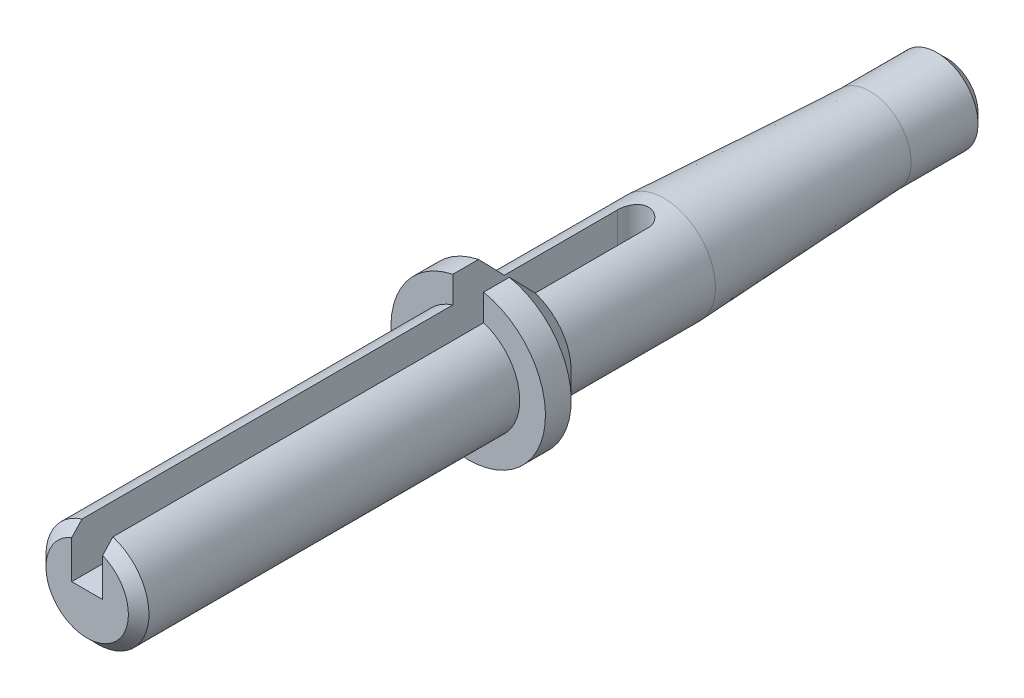
ISO-10303-21;
HEADER;
FILE_DESCRIPTION(('STEP AP214'),'2;1');
FILE_NAME('part.step','',(''),(''),'','','');
FILE_SCHEMA(('AUTOMOTIVE_DESIGN { 1 0 10303 214 1 1 1 1 }'));
ENDSEC;
DATA;
#1=APPLICATION_CONTEXT('core data for automotive mechanical design processes');
#2=APPLICATION_PROTOCOL_DEFINITION('international standard','automotive_design',2000,#1);
#3=PRODUCT_CONTEXT('',#1,'mechanical');
#4=PRODUCT('Part','Part','',(#3));
#5=PRODUCT_RELATED_PRODUCT_CATEGORY('part','',(#4));
#6=PRODUCT_DEFINITION_FORMATION('','',#4);
#7=PRODUCT_DEFINITION_CONTEXT('part definition',#1,'design');
#8=PRODUCT_DEFINITION('design','',#6,#7);
#9=PRODUCT_DEFINITION_SHAPE('','',#8);
#10=(LENGTH_UNIT() NAMED_UNIT(*) SI_UNIT(.MILLI.,.METRE.));
#11=(NAMED_UNIT(*) PLANE_ANGLE_UNIT() SI_UNIT($,.RADIAN.));
#12=(NAMED_UNIT(*) SI_UNIT($,.STERADIAN.) SOLID_ANGLE_UNIT());
#13=UNCERTAINTY_MEASURE_WITH_UNIT(LENGTH_MEASURE(1.E-05),#10,'distance_accuracy_value','');
#14=(GEOMETRIC_REPRESENTATION_CONTEXT(3) GLOBAL_UNCERTAINTY_ASSIGNED_CONTEXT((#13)) GLOBAL_UNIT_ASSIGNED_CONTEXT((#10,
#11,#12)) REPRESENTATION_CONTEXT('',''));
#15=CARTESIAN_POINT('',(0.,0.,0.));
#16=DIRECTION('',(0.,0.,1.));
#17=DIRECTION('',(1.,0.,0.));
#18=AXIS2_PLACEMENT_3D('',#15,#16,#17);
#19=CARTESIAN_POINT('',(0.,0.,16.5));
#20=DIRECTION('',(0.,0.,-1.));
#21=DIRECTION('',(-1.,0.,0.));
#22=AXIS2_PLACEMENT_3D('',#19,#20,#21);
#23=CYLINDRICAL_SURFACE('',#22,5.);
#24=CARTESIAN_POINT('',(0.,0.,0.));
#25=DIRECTION('',(0.,0.,-1.));
#26=DIRECTION('',(-1.,0.,0.));
#27=AXIS2_PLACEMENT_3D('',#24,#25,#26);
#28=CIRCLE('',#27,5.);
#29=CARTESIAN_POINT('',(-5.,0.,0.));
#30=VERTEX_POINT('',#29);
#31=EDGE_CURVE('E260',#30,#30,#28,.T.);
#32=ORIENTED_EDGE('',*,*,#31,.F.);
#33=EDGE_LOOP('',(#32));
#34=FACE_BOUND('',#33,.T.);
#35=DIRECTION('',(0.,0.,-1.));
#36=VECTOR('',#35,1.);
#37=CARTESIAN_POINT('',(-1.49999999999999,4.76969600708473,16.5));
#38=LINE('',#37,#36);
#39=CARTESIAN_POINT('',(-1.49999999999999,4.76969600708473,3.));
#40=VERTEX_POINT('',#39);
#41=CARTESIAN_POINT('',(-1.49999999999999,4.76969600708473,14.));
#42=VERTEX_POINT('',#41);
#43=EDGE_CURVE('E68',#40,#42,#38,.F.);
#44=ORIENTED_EDGE('',*,*,#43,.F.);
#45=CARTESIAN_POINT('',(1.49999999999999,4.76969600708473,3.));
#46=CARTESIAN_POINT('',(1.5000008535707,4.76969249084934,2.95882060709199));
#47=CARTESIAN_POINT('',(1.49830317083427,4.77022997000129,2.91766195687388));
#48=CARTESIAN_POINT('',(1.49153785660316,4.77235095109999,2.83565883790444));
#49=CARTESIAN_POINT('',(1.4864709827584,4.77393421787376,2.79481430060511));
#50=CARTESIAN_POINT('',(1.4663020368931,4.78018490618873,2.67340945904534));
#51=CARTESIAN_POINT('',(1.44623120413662,4.78635370384275,2.59369360958363));
#52=CARTESIAN_POINT('',(1.39353102315626,4.80195952113208,2.43896442161414));
#53=CARTESIAN_POINT('',(1.36090607068203,4.81139539670393,2.36394944780192));
#54=CARTESIAN_POINT('',(1.28407841117655,4.83246571212052,2.2204033184024));
#55=CARTESIAN_POINT('',(1.23987031651226,4.84410117434933,2.15187520027157));
#56=CARTESIAN_POINT('',(1.13964850658325,4.86866835244721,2.02113394400295));
#57=CARTESIAN_POINT('',(1.08333433465208,4.88162755412974,1.9591563396566));
#58=CARTESIAN_POINT('',(0.96113891987335,4.90714811559049,1.84536441610004));
#59=CARTESIAN_POINT('',(0.895256063916344,4.91970940785249,1.79355181399695));
#60=CARTESIAN_POINT('',(0.754109921315427,4.94333239727705,1.70053622968151));
#61=CARTESIAN_POINT('',(0.678680819336256,4.95435770971354,1.65957481970205));
#62=CARTESIAN_POINT('',(0.521621185505772,4.97334469846208,1.59101158838185));
#63=CARTESIAN_POINT('',(0.439992259012926,4.98130716463903,1.56340632220573));
#64=CARTESIAN_POINT('',(0.275324697874878,4.99307639935002,1.52312020089796));
#65=CARTESIAN_POINT('',(0.192393125294253,4.99699549276993,1.51003514203026));
#66=CARTESIAN_POINT('',(0.0254235719980819,5.00063202022426,1.49788265863674));
#67=CARTESIAN_POINT('',(-0.0586141962423622,5.00035024971471,1.49881258029984));
#68=CARTESIAN_POINT('',(-0.222571599946016,4.99569602566267,1.514392908759));
#69=CARTESIAN_POINT('',(-0.30253714546464,4.99145415509187,1.52860534497872));
#70=CARTESIAN_POINT('',(-0.458890052102024,4.9795151369998,1.56963163523811));
#71=CARTESIAN_POINT('',(-0.535277225531996,4.97181780846028,1.59644614945594));
#72=CARTESIAN_POINT('',(-0.683347815892214,4.95365214926145,1.66221222164644));
#73=CARTESIAN_POINT('',(-0.75496600604414,4.94315255692525,1.70130164435695));
#74=CARTESIAN_POINT('',(-0.890765529574417,4.92049624651755,1.79039859004832));
#75=CARTESIAN_POINT('',(-0.954945191614591,4.90833915735884,1.84040855947884));
#76=CARTESIAN_POINT('',(-1.07665450541274,4.88311673571409,1.95219198808352));
#77=CARTESIAN_POINT('',(-1.13383351478033,4.87003445449554,2.01434386376075));
#78=CARTESIAN_POINT('',(-1.23706769492487,4.84484215114658,2.14749742342792));
#79=CARTESIAN_POINT('',(-1.28311962013077,4.83273241337566,2.21850168036553));
#80=CARTESIAN_POINT('',(-1.36316407240863,4.81077228795653,2.36828092844929));
#81=CARTESIAN_POINT('',(-1.39703006341134,4.80094596245948,2.44712717959341));
#82=CARTESIAN_POINT('',(-1.45085886004698,4.78495663653201,2.60972450398174));
#83=CARTESIAN_POINT('',(-1.47084293218035,4.77878803475875,2.69346786071438));
#84=CARTESIAN_POINT('',(-1.48901203590079,4.77314032325006,2.81499488907019));
#85=CARTESIAN_POINT('',(-1.49313202989008,4.77185156275267,2.85189073417961));
#86=CARTESIAN_POINT('',(-1.49862355614853,4.77012928611782,2.92585147909953));
#87=CARTESIAN_POINT('',(-1.49999912968268,4.76969451246644,2.96291604966386));
#88=CARTESIAN_POINT('',(-1.49999999999999,4.76969600708473,3.));
#89=B_SPLINE_CURVE_WITH_KNOTS('',3,(#45,#46,#47,#48,#49,#50,#51,#52,#53,#54,#55,#56,#57,#58,#59,
#60,#61,#62,#63,#64,#65,#66,#67,#68,#69,#70,#71,#72,#73,#74,#75,#76,#77,#78,#79,#80,#81,#82,#83,
#84,#85,#86,#87,#88),.UNSPECIFIED.,.F.,.F.,(4,2,2,2,2,2,2,2,2,2,2,2,2,2,2,2,2,2,2,2,2,4),(0.,
0.123459071219734,0.246890388853042,0.492911349615209,0.738846245884322,0.984895736828089,
1.23795510798803,1.49105719006936,1.74939356197454,2.00766326783255,2.25854751319801,
2.50938425289469,2.75223130012965,2.99509107067834,3.24078242562729,3.48652887757003,
3.74172568310979,3.99699683536776,4.25484698071525,4.51230123440205,4.62365084745807,
4.73483637253613),.UNSPECIFIED.);
#90=CARTESIAN_POINT('',(1.49999999999999,4.76969600708473,3.));
#91=VERTEX_POINT('',#90);
#92=EDGE_CURVE('E11',#91,#40,#89,.T.);
#93=ORIENTED_EDGE('',*,*,#92,.F.);
#94=DIRECTION('',(0.,0.,-1.));
#95=VECTOR('',#94,1.);
#96=CARTESIAN_POINT('',(1.5,4.76969600708473,16.5));
#97=LINE('',#96,#95);
#98=CARTESIAN_POINT('',(1.5,4.76969600708473,14.));
#99=VERTEX_POINT('',#98);
#100=EDGE_CURVE('E154',#99,#91,#97,.T.);
#101=ORIENTED_EDGE('',*,*,#100,.F.);
#102=CARTESIAN_POINT('',(0.,0.,14.));
#103=DIRECTION('',(0.,0.,1.));
#104=DIRECTION('',(1.,0.,0.));
#105=AXIS2_PLACEMENT_3D('',#102,#103,#104);
#106=CIRCLE('',#105,5.);
#107=EDGE_CURVE('E245',#99,#42,#106,.F.);
#108=ORIENTED_EDGE('',*,*,#107,.T.);
#109=EDGE_LOOP('',(#44,#93,#101,#108));
#110=FACE_BOUND('',#109,.T.);
#111=ADVANCED_FACE('F40',(#34,#110),#23,.T.);
#112=CARTESIAN_POINT('',(0.,0.,56.));
#113=DIRECTION('',(0.,0.,-1.));
#114=DIRECTION('',(-1.,0.,0.));
#115=AXIS2_PLACEMENT_3D('',#112,#113,#114);
#116=CYLINDRICAL_SURFACE('',#115,7.5);
#117=DIRECTION('',(0.,0.,-1.));
#118=VECTOR('',#117,1.);
#119=CARTESIAN_POINT('',(-1.49999999999999,7.34846922834954,56.));
#120=LINE('',#119,#118);
#121=CARTESIAN_POINT('',(-1.49999999999999,7.34846922834954,16.5));
#122=VERTEX_POINT('',#121);
#123=CARTESIAN_POINT('',(-1.49999999999999,7.34846922834954,19.));
#124=VERTEX_POINT('',#123);
#125=EDGE_CURVE('E269',#122,#124,#120,.F.);
#126=ORIENTED_EDGE('',*,*,#125,.F.);
#127=CARTESIAN_POINT('',(0.,0.,16.5));
#128=DIRECTION('',(0.,0.,1.));
#129=DIRECTION('',(1.,0.,0.));
#130=AXIS2_PLACEMENT_3D('',#127,#128,#129);
#131=CIRCLE('',#130,7.5);
#132=CARTESIAN_POINT('',(1.50000000000001,7.34846922834953,16.5));
#133=VERTEX_POINT('',#132);
#134=EDGE_CURVE('E248',#122,#133,#131,.T.);
#135=ORIENTED_EDGE('',*,*,#134,.T.);
#136=DIRECTION('',(0.,0.,-1.));
#137=VECTOR('',#136,1.);
#138=CARTESIAN_POINT('',(1.50000000000001,7.34846922834953,56.));
#139=LINE('',#138,#137);
#140=CARTESIAN_POINT('',(1.5,7.34846922834953,19.));
#141=VERTEX_POINT('',#140);
#142=EDGE_CURVE('E145',#141,#133,#139,.T.);
#143=ORIENTED_EDGE('',*,*,#142,.F.);
#144=CARTESIAN_POINT('',(0.,0.,19.));
#145=DIRECTION('',(0.,0.,-1.));
#146=DIRECTION('',(-1.,0.,0.));
#147=AXIS2_PLACEMENT_3D('',#144,#145,#146);
#148=CIRCLE('',#147,7.5);
#149=EDGE_CURVE('E249',#141,#124,#148,.T.);
#150=ORIENTED_EDGE('',*,*,#149,.T.);
#151=EDGE_LOOP('',(#126,#135,#143,#150));
#152=FACE_BOUND('',#151,.T.);
#153=ADVANCED_FACE('F195',(#152),#116,.T.);
#154=CARTESIAN_POINT('',(8.,0.,19.));
#155=DIRECTION('',(0.,0.,-1.));
#156=DIRECTION('',(-1.,0.,0.));
#157=AXIS2_PLACEMENT_3D('',#154,#155,#156);
#158=PLANE('',#157);
#159=DIRECTION('',(0.,-1.,0.));
#160=VECTOR('',#159,1.);
#161=CARTESIAN_POINT('',(-1.49999999999999,0.,19.));
#162=LINE('',#161,#160);
#163=CARTESIAN_POINT('',(-1.49999999999999,4.76969600708473,19.));
#164=VERTEX_POINT('',#163);
#165=EDGE_CURVE('E271',#124,#164,#162,.T.);
#166=ORIENTED_EDGE('',*,*,#165,.F.);
#167=ORIENTED_EDGE('',*,*,#149,.F.);
#168=DIRECTION('',(0.,1.,0.));
#169=VECTOR('',#168,1.);
#170=CARTESIAN_POINT('',(1.5,0.,19.));
#171=LINE('',#170,#169);
#172=CARTESIAN_POINT('',(1.50000000000001,4.76969600708473,19.));
#173=VERTEX_POINT('',#172);
#174=EDGE_CURVE('E143',#173,#141,#171,.T.);
#175=ORIENTED_EDGE('',*,*,#174,.F.);
#176=CARTESIAN_POINT('',(0.,0.,19.));
#177=DIRECTION('',(0.,0.,1.));
#178=DIRECTION('',(1.,0.,0.));
#179=AXIS2_PLACEMENT_3D('',#176,#177,#178);
#180=CIRCLE('',#179,5.);
#181=EDGE_CURVE('E252',#164,#173,#180,.T.);
#182=ORIENTED_EDGE('',*,*,#181,.F.);
#183=EDGE_LOOP('',(#166,#167,#175,#182));
#184=FACE_BOUND('',#183,.T.);
#185=ADVANCED_FACE('F200',(#184),#158,.F.);
#186=CARTESIAN_POINT('',(0.,0.,56.));
#187=DIRECTION('',(0.,0.,1.));
#188=DIRECTION('',(1.,0.,0.));
#189=AXIS2_PLACEMENT_3D('',#186,#187,#188);
#190=CYLINDRICAL_SURFACE('',#189,5.);
#191=DIRECTION('',(0.,0.,1.));
#192=VECTOR('',#191,1.);
#193=CARTESIAN_POINT('',(-1.49999999999999,4.76969600708473,56.));
#194=LINE('',#193,#192);
#195=CARTESIAN_POINT('',(-1.49999999999999,4.76969600708473,55.));
#196=VERTEX_POINT('',#195);
#197=EDGE_CURVE('E273',#164,#196,#194,.T.);
#198=ORIENTED_EDGE('',*,*,#197,.F.);
#199=ORIENTED_EDGE('',*,*,#181,.T.);
#200=DIRECTION('',(0.,0.,1.));
#201=VECTOR('',#200,1.);
#202=CARTESIAN_POINT('',(1.50000000000001,4.76969600708473,56.));
#203=LINE('',#202,#201);
#204=CARTESIAN_POINT('',(1.50000000000001,4.7696960070848,55.));
#205=VERTEX_POINT('',#204);
#206=EDGE_CURVE('E141',#205,#173,#203,.F.);
#207=ORIENTED_EDGE('',*,*,#206,.F.);
#208=CARTESIAN_POINT('',(0.,0.,55.));
#209=DIRECTION('',(0.,0.,1.));
#210=DIRECTION('',(1.,0.,0.));
#211=AXIS2_PLACEMENT_3D('',#208,#209,#210);
#212=CIRCLE('',#211,5.);
#213=EDGE_CURVE('E240',#205,#196,#212,.F.);
#214=ORIENTED_EDGE('',*,*,#213,.T.);
#215=EDGE_LOOP('',(#198,#199,#207,#214));
#216=FACE_BOUND('',#215,.T.);
#217=ADVANCED_FACE('F209',(#216),#190,.T.);
#218=CARTESIAN_POINT('',(0.,0.,56.));
#219=DIRECTION('',(0.,0.,1.));
#220=DIRECTION('',(1.,0.,0.));
#221=AXIS2_PLACEMENT_3D('',#218,#219,#220);
#222=PLANE('',#221);
#223=DIRECTION('',(1.,0.,0.));
#224=VECTOR('',#223,1.);
#225=CARTESIAN_POINT('',(0.,0.,56.));
#226=LINE('',#225,#224);
#227=CARTESIAN_POINT('',(-1.49999999999999,0.,56.));
#228=VERTEX_POINT('',#227);
#229=CARTESIAN_POINT('',(1.50000000000001,0.,56.));
#230=VERTEX_POINT('',#229);
#231=EDGE_CURVE('E53',#228,#230,#226,.T.);
#232=ORIENTED_EDGE('',*,*,#231,.F.);
#233=DIRECTION('',(0.,1.,0.));
#234=VECTOR('',#233,1.);
#235=CARTESIAN_POINT('',(-1.49999999999999,0.,56.));
#236=LINE('',#235,#234);
#237=CARTESIAN_POINT('',(-1.49999999999999,3.70809924354794,55.9999999999999));
#238=VERTEX_POINT('',#237);
#239=EDGE_CURVE('E129',#228,#238,#236,.T.);
#240=ORIENTED_EDGE('',*,*,#239,.T.);
#241=CARTESIAN_POINT('',(0.,0.,56.));
#242=DIRECTION('',(0.,0.,1.));
#243=DIRECTION('',(1.,0.,0.));
#244=AXIS2_PLACEMENT_3D('',#241,#242,#243);
#245=CIRCLE('',#244,3.99999999999998);
#246=CARTESIAN_POINT('',(1.50000000000001,3.70809924354781,56.));
#247=VERTEX_POINT('',#246);
#248=EDGE_CURVE('E238',#238,#247,#245,.T.);
#249=ORIENTED_EDGE('',*,*,#248,.T.);
#250=DIRECTION('',(0.,-1.,0.));
#251=VECTOR('',#250,1.);
#252=CARTESIAN_POINT('',(1.50000000000001,0.,56.));
#253=LINE('',#252,#251);
#254=EDGE_CURVE('E60',#247,#230,#253,.T.);
#255=ORIENTED_EDGE('',*,*,#254,.T.);
#256=EDGE_LOOP('',(#232,#240,#249,#255));
#257=FACE_BOUND('',#256,.T.);
#258=ADVANCED_FACE('F191',(#257),#222,.T.);
#259=CARTESIAN_POINT('',(0.,0.,16.5));
#260=DIRECTION('',(0.,0.,1.));
#261=DIRECTION('',(1.,0.,0.));
#262=AXIS2_PLACEMENT_3D('',#259,#260,#261);
#263=CONICAL_SURFACE('',#262,7.50000000000001,0.785398163397453);
#264=CARTESIAN_POINT('',(-1.49999999999999,-4.74361649025257,13.9751278784164));
#265=CARTESIAN_POINT('',(-1.49999999999999,-4.57533837643194,13.8147393966721));
#266=CARTESIAN_POINT('',(-1.49999999999999,-4.40672502156798,13.6546964075414));
#267=CARTESIAN_POINT('',(-1.49999999999999,-4.06837035867825,13.3357007809533));
#268=CARTESIAN_POINT('',(-1.49999999999999,-3.89862871119326,13.1767485038686));
#269=CARTESIAN_POINT('',(-1.49999999999999,-3.55606697381008,12.8589523312724));
#270=CARTESIAN_POINT('',(-1.49999999999999,-3.38323294255197,12.7001234322267));
#271=CARTESIAN_POINT('',(-1.49999999999999,-3.03536064300995,12.3849555119297));
#272=CARTESIAN_POINT('',(-1.49999999999999,-2.86032282820032,12.2286159929602));
#273=CARTESIAN_POINT('',(-1.49999999999999,-2.56549419877455,11.9712743297103));
#274=CARTESIAN_POINT('',(-1.49999999999999,-2.44668255848396,11.8691546543987));
#275=CARTESIAN_POINT('',(-1.49999999999999,-2.20678189549785,11.667516855371));
#276=CARTESIAN_POINT('',(-1.49999999999999,-2.08569195979667,11.5679998145349));
#277=CARTESIAN_POINT('',(-1.49999999999999,-1.84052727612303,11.3731739036729));
#278=CARTESIAN_POINT('',(-1.49999999999999,-1.71645915050729,11.2778568310002));
#279=CARTESIAN_POINT('',(-1.49999999999999,-1.52676043995113,11.1398941388509));
#280=CARTESIAN_POINT('',(-1.49999999999999,-1.4629482617242,11.0947551526211));
#281=CARTESIAN_POINT('',(-1.49999999999999,-1.33381703066989,11.0066953351985));
#282=CARTESIAN_POINT('',(-1.49999999999999,-1.26849827583487,10.9637740707033));
#283=CARTESIAN_POINT('',(-1.49999999999999,-1.15088480562107,10.8902208058331));
#284=CARTESIAN_POINT('',(-1.49999999999999,-1.09896296219977,10.8589951167142));
#285=CARTESIAN_POINT('',(-1.49999999999999,-0.99379629200357,10.7988240825456));
#286=CARTESIAN_POINT('',(-1.49999999999999,-0.940551280404507,10.7698790584481));
#287=CARTESIAN_POINT('',(-1.49999999999999,-0.832596982696743,10.7149530389066));
#288=CARTESIAN_POINT('',(-1.49999999999999,-0.777889163473515,10.688969202192));
#289=CARTESIAN_POINT('',(-1.49999999999999,-0.666853538244706,10.6407877676181));
#290=CARTESIAN_POINT('',(-1.49999999999999,-0.610526215574323,10.618589053532));
#291=CARTESIAN_POINT('',(-1.49999999999999,-0.465576115821289,10.5684484540411));
#292=CARTESIAN_POINT('',(-1.49999999999999,-0.375744225634067,10.5437534130274));
#293=CARTESIAN_POINT('',(-1.49999999999999,-0.238990841255244,10.5182569162825));
#294=CARTESIAN_POINT('',(-1.49999999999999,-0.193119235814414,10.5116832561727));
#295=CARTESIAN_POINT('',(-1.49999999999999,-0.100959529145014,10.5026960031789));
#296=CARTESIAN_POINT('',(-1.49999999999999,-0.0546714559862784,10.5002821320063));
#297=CARTESIAN_POINT('',(-1.49999999999999,0.0381143034511735,10.4997635502598));
#298=CARTESIAN_POINT('',(-1.49999999999999,0.0846120827134771,10.5016762447354));
#299=CARTESIAN_POINT('',(-1.49999999999999,0.177236950290616,10.5097295591938));
#300=CARTESIAN_POINT('',(-1.49999999999999,0.223364013815017,10.5158704595833));
#301=CARTESIAN_POINT('',(-1.49999999999999,0.315016506340354,10.5320556495979));
#302=CARTESIAN_POINT('',(-1.49999999999999,0.360540494306865,10.5421079831441));
#303=CARTESIAN_POINT('',(-1.49999999999999,0.450683322740067,10.5656378367327));
#304=CARTESIAN_POINT('',(-1.49999999999999,0.495302088749361,10.5791156373072));
#305=CARTESIAN_POINT('',(-1.49999999999999,0.634065890107939,10.6260674219329));
#306=CARTESIAN_POINT('',(-1.49999999999999,0.726441699516837,10.6647713298643));
#307=CARTESIAN_POINT('',(-1.49999999999999,0.90695487512322,10.751071798339));
#308=CARTESIAN_POINT('',(-1.49999999999999,0.995083742309733,10.7986853294345));
#309=CARTESIAN_POINT('',(-1.49999999999999,1.16863158034084,10.9001879889387));
#310=CARTESIAN_POINT('',(-1.49999999999999,1.25402053671815,10.9541278127437));
#311=CARTESIAN_POINT('',(-1.49999999999999,1.38003002697313,11.0380166453884));
#312=CARTESIAN_POINT('',(-1.49999999999999,1.42167057003564,11.066463600744));
#313=CARTESIAN_POINT('',(-1.49999999999999,1.50436207307662,11.1242006697196));
#314=CARTESIAN_POINT('',(-1.49999999999999,1.54541305425653,11.153490752905));
#315=CARTESIAN_POINT('',(-1.49999999999999,1.67533646806793,11.2478850206988));
#316=CARTESIAN_POINT('',(-1.49999999999999,1.76324854177269,11.3143099405895));
#317=CARTESIAN_POINT('',(-1.49999999999999,1.93726637406178,11.4494921798845));
#318=CARTESIAN_POINT('',(-1.49999999999999,2.02337185050834,11.5182498592739));
#319=CARTESIAN_POINT('',(-1.49999999999999,2.19424180279809,11.6574882453976));
#320=CARTESIAN_POINT('',(-1.49999999999999,2.27900562981792,11.7279697462208));
#321=CARTESIAN_POINT('',(-1.49999999999999,2.44746416229022,11.8702010886147));
#322=CARTESIAN_POINT('',(-1.49999999999999,2.53115882886276,11.9419509760852));
#323=CARTESIAN_POINT('',(-1.49999999999999,2.7812792104379,12.158885865462));
#324=CARTESIAN_POINT('',(-1.49999999999999,2.94645054546515,12.3055154257225));
#325=CARTESIAN_POINT('',(-1.49999999999999,3.27459547660093,12.6011055693355));
#326=CARTESIAN_POINT('',(-1.49999999999999,3.43756967748566,12.7500654858017));
#327=CARTESIAN_POINT('',(-1.49999999999999,3.76143039580486,13.0490115107534));
#328=CARTESIAN_POINT('',(-1.49999999999999,3.92232248400104,13.1989915917646));
#329=CARTESIAN_POINT('',(-1.49999999999999,4.24307440309937,13.5000719398126));
#330=CARTESIAN_POINT('',(-1.49999999999999,4.40293416038012,13.6511722851267));
#331=CARTESIAN_POINT('',(-1.49999999999999,4.8810583326699,14.105360366785));
#332=CARTESIAN_POINT('',(-1.49999999999999,5.19819221101114,14.409637366464));
#333=CARTESIAN_POINT('',(-1.49999999999999,5.79351060068779,14.9841066139285));
#334=CARTESIAN_POINT('',(-1.49999999999999,6.07188908665476,15.2540985349239));
#335=CARTESIAN_POINT('',(-1.49999999999999,6.6277183792732,15.7950405090278));
#336=CARTESIAN_POINT('',(-1.49999999999999,6.90516917759819,16.0659905706914));
#337=CARTESIAN_POINT('',(-1.49999999999999,7.73678495843135,16.8800274656606));
#338=CARTESIAN_POINT('',(-1.49999999999999,8.28999492431769,17.4240892189502));
#339=CARTESIAN_POINT('',(-1.49999999999999,9.39515247100779,18.5137043598383));
#340=CARTESIAN_POINT('',(-1.49999999999999,9.94709978751865,19.0592580150965));
#341=CARTESIAN_POINT('',(-1.49999999999999,10.7742696290419,19.8781150094411));
#342=CARTESIAN_POINT('',(-1.49999999999999,11.0498097890698,20.1510975652752));
#343=CARTESIAN_POINT('',(-1.49999999999999,11.6007170868734,20.6972364605955));
#344=CARTESIAN_POINT('',(-1.49999999999999,11.8760842248865,20.9703927998422));
#345=CARTESIAN_POINT('',(-1.49999999999999,12.1513844791606,21.2436164902526));
#346=B_SPLINE_CURVE_WITH_KNOTS('',3,(#264,#265,#266,#267,#268,#269,#270,#271,#272,#273,#274,
#275,#276,#277,#278,#279,#280,#281,#282,#283,#284,#285,#286,#287,#288,#289,#290,#291,#292,#293,
#294,#295,#296,#297,#298,#299,#300,#301,#302,#303,#304,#305,#306,#307,#308,#309,#310,#311,#312,
#313,#314,#315,#316,#317,#318,#319,#320,#321,#322,#323,#324,#325,#326,#327,#328,#329,#330,#331,
#332,#333,#334,#335,#336,#337,#338,#339,#340,#341,#342,#343,#344,#345),.UNSPECIFIED.,.F.,.F.,(4,
2,2,2,2,2,2,2,2,2,2,2,2,2,2,2,2,2,2,2,2,2,2,2,2,2,2,2,2,2,2,2,2,2,2,2,2,2,2,2,4),(0.,
0.697414178177019,1.39504864574023,2.09922568876207,2.80326012695118,3.27323446188466,
3.74340132484999,4.21260507358656,4.44706300691542,4.68147495686746,4.86319411066734,
5.04493879183397,5.22650759332727,5.40802275750261,5.68630114362441,5.82516145050175,
5.96401246730842,6.10342305143493,6.24284288189967,6.38255095975315,6.52227048283029,
6.82191706079066,7.12214030824477,7.42495905744991,7.57624208698045,7.7275196624791,
8.05801211618208,8.38855580465611,8.71925473995991,9.04996566706767,9.71251952879988,
10.3748871330568,11.0347448154137,11.6946490475009,13.0131271371685,14.1765305466798,
15.3399443704688,17.6676846898875,19.995874335817,21.1594793046967,22.3230826735321),.UNSPECIFIED.);
#347=EDGE_CURVE('E264',#42,#122,#346,.T.);
#348=ORIENTED_EDGE('',*,*,#347,.F.);
#349=ORIENTED_EDGE('',*,*,#107,.F.);
#350=CARTESIAN_POINT('',(1.5,12.1513844791606,21.2436164902526));
#351=CARTESIAN_POINT('',(1.5,11.7839959047857,20.8790094774705));
#352=CARTESIAN_POINT('',(1.5,11.416496327089,20.5145140976593));
#353=CARTESIAN_POINT('',(1.5,10.6810707398575,19.7857655013735));
#354=CARTESIAN_POINT('',(1.5,10.3131446452545,19.421512370755));
#355=CARTESIAN_POINT('',(1.5,9.57495629343852,18.6915818477669));
#356=CARTESIAN_POINT('',(1.5,9.20469175263853,18.3259067642553));
#357=CARTESIAN_POINT('',(1.5,8.46362261090628,17.5952910867834));
#358=CARTESIAN_POINT('',(1.5,8.09281816987232,17.2303503307343));
#359=CARTESIAN_POINT('',(1.5,7.47957131159116,16.6283598411925));
#360=CARTESIAN_POINT('',(1.5,7.23739998803109,16.3910340154413));
#361=CARTESIAN_POINT('',(1.5,6.75251423348375,15.9169253053296));
#362=CARTESIAN_POINT('',(1.5,6.50979978888442,15.6801424348852));
#363=CARTESIAN_POINT('',(1.5,6.02342778250183,15.2071300979162));
#364=CARTESIAN_POINT('',(1.5,5.77976959194862,14.9709012773469));
#365=CARTESIAN_POINT('',(1.5,5.29142490874165,14.4995541482031));
#366=CARTESIAN_POINT('',(1.5,5.04673851453743,14.264435737689));
#367=CARTESIAN_POINT('',(1.5,4.55678222845001,13.7967575873255));
#368=CARTESIAN_POINT('',(1.5,4.31151851645426,13.5641913933377));
#369=CARTESIAN_POINT('',(1.5,3.94172346962018,13.2172731657988));
#370=CARTESIAN_POINT('',(1.5,3.81811861172637,13.1019342398027));
#371=CARTESIAN_POINT('',(1.5,3.57009969702013,12.8721343439301));
#372=CARTESIAN_POINT('',(1.5,3.44568565871573,12.7576733541026));
#373=CARTESIAN_POINT('',(1.5,3.1959795143489,12.5301052018258));
#374=CARTESIAN_POINT('',(1.5,3.07068908860729,12.4169961998569));
#375=CARTESIAN_POINT('',(1.5,2.81865223283755,12.1924168753532));
#376=CARTESIAN_POINT('',(1.5,2.69190584592812,12.0809465045117));
#377=CARTESIAN_POINT('',(1.5,2.43643723434719,11.8604256255959));
#378=CARTESIAN_POINT('',(1.5,2.30771619134145,11.7513737590097));
#379=CARTESIAN_POINT('',(1.5,2.1123959233938,11.590534911617));
#380=CARTESIAN_POINT('',(1.5,2.04692168065033,11.5373828328428));
#381=CARTESIAN_POINT('',(1.5,1.91504591341828,11.4322436336952));
#382=CARTESIAN_POINT('',(1.5,1.84864443519306,11.380256455535));
#383=CARTESIAN_POINT('',(1.5,1.73811357581661,11.2957035763291));
#384=CARTESIAN_POINT('',(1.5,1.69431626624849,11.2627039685761));
#385=CARTESIAN_POINT('',(1.5,1.60615397668426,11.1974646169979));
#386=CARTESIAN_POINT('',(1.5,1.56178896132842,11.1652249208629));
#387=CARTESIAN_POINT('',(1.5,1.4723710559602,11.1016389166229));
#388=CARTESIAN_POINT('',(1.5,1.42731767797968,11.0702932921753));
#389=CARTESIAN_POINT('',(1.5,1.33644971988622,11.0087274515762));
#390=CARTESIAN_POINT('',(1.5,1.29063515108678,10.9785072187195));
#391=CARTESIAN_POINT('',(1.5,1.15277502617896,10.8904717862476));
#392=CARTESIAN_POINT('',(1.5,1.05943810152379,10.834647696089));
#393=CARTESIAN_POINT('',(1.5,0.868268979029899,10.7313100395597));
#394=CARTESIAN_POINT('',(1.5,0.770443737792509,10.6837841267264));
#395=CARTESIAN_POINT('',(1.5,0.623033882373341,10.6236846843293));
#396=CARTESIAN_POINT('',(1.5,0.575545899279027,10.6059881184149));
#397=CARTESIAN_POINT('',(1.5,0.479398248023857,10.5740916217069));
#398=CARTESIAN_POINT('',(1.5,0.430738716518954,10.5598912852421));
#399=CARTESIAN_POINT('',(1.5,0.332714820080642,10.5357283863758));
#400=CARTESIAN_POINT('',(1.5,0.283357518267869,10.525737603876));
#401=CARTESIAN_POINT('',(1.5,0.183925832814502,10.5104365887681));
#402=CARTESIAN_POINT('',(1.5,0.133851691970348,10.5051248077761));
#403=CARTESIAN_POINT('',(1.5,0.0329398871750466,10.4995081539498));
#404=CARTESIAN_POINT('',(1.5,-0.0179005118091509,10.4992513055908));
#405=CARTESIAN_POINT('',(1.5,-0.119342314211212,10.5038863191577));
#406=CARTESIAN_POINT('',(1.5,-0.169943709662906,10.5087783515));
#407=CARTESIAN_POINT('',(1.5,-0.270730279776932,10.5234144934129));
#408=CARTESIAN_POINT('',(1.5,-0.320911275407682,10.5331868793098));
#409=CARTESIAN_POINT('',(1.5,-0.420237476304014,10.5570075273393));
#410=CARTESIAN_POINT('',(1.5,-0.469382470166556,10.571056653309));
#411=CARTESIAN_POINT('',(1.5,-0.608783200906209,10.6165495684842));
#412=CARTESIAN_POINT('',(1.5,-0.697568509938691,10.6524867447662));
#413=CARTESIAN_POINT('',(1.5,-0.87117426523225,10.7329163062631));
#414=CARTESIAN_POINT('',(1.5,-0.955987926279707,10.7774227126505));
#415=CARTESIAN_POINT('',(1.5,-1.12342018828092,10.8727742000431));
#416=CARTESIAN_POINT('',(1.5,-1.20599491779154,10.9236953349051));
#417=CARTESIAN_POINT('',(1.5,-1.3278387806563,11.003051752988));
#418=CARTESIAN_POINT('',(1.5,-1.36810292635591,11.0299894670363));
#419=CARTESIAN_POINT('',(1.5,-1.44805357781689,11.0847082685869));
#420=CARTESIAN_POINT('',(1.5,-1.48774010061665,11.1124893311376));
#421=CARTESIAN_POINT('',(1.5,-1.60378589147391,11.1952764858787));
#422=CARTESIAN_POINT('',(1.5,-1.67944785543653,11.2512590794854));
#423=CARTESIAN_POINT('',(1.5,-1.82930375858491,11.3651613833087));
#424=CARTESIAN_POINT('',(1.5,-1.90349750955983,11.423081339349));
#425=CARTESIAN_POINT('',(1.5,-2.05075534209058,11.5403968377347));
#426=CARTESIAN_POINT('',(1.5,-2.12381895242934,11.5997929700308));
#427=CARTESIAN_POINT('',(1.5,-2.2690228563993,11.7197050474173));
#428=CARTESIAN_POINT('',(1.5,-2.34116311812093,11.7802210310324));
#429=CARTESIAN_POINT('',(1.5,-2.55677690217141,11.9633255302136));
#430=CARTESIAN_POINT('',(1.5,-2.69913751580266,12.0872233065831));
#431=CARTESIAN_POINT('',(1.5,-2.98183772008295,12.3372206078641));
#432=CARTESIAN_POINT('',(1.5,-3.12217779024798,12.4633195941266));
#433=CARTESIAN_POINT('',(1.5,-3.38717588983676,12.7040821731727));
#434=CARTESIAN_POINT('',(1.5,-3.5119698730529,12.8185963637561));
#435=CARTESIAN_POINT('',(1.5,-3.76071806414212,13.0485498679683));
#436=CARTESIAN_POINT('',(1.5,-3.8846722104798,13.1639892480619));
#437=CARTESIAN_POINT('',(1.5,-4.13141719461168,13.3950813421007));
#438=CARTESIAN_POINT('',(1.5,-4.2542107251569,13.510731184114));
#439=CARTESIAN_POINT('',(1.5,-4.49927213611972,13.7425634827808));
#440=CARTESIAN_POINT('',(1.5,-4.62154006520736,13.8587458879672));
#441=CARTESIAN_POINT('',(1.5,-4.74361649025257,13.9751278784164));
#442=B_SPLINE_CURVE_WITH_KNOTS('',3,(#350,#351,#352,#353,#354,#355,#356,#357,#358,#359,#360,
#361,#362,#363,#364,#365,#366,#367,#368,#369,#370,#371,#372,#373,#374,#375,#376,#377,#378,#379,
#380,#381,#382,#383,#384,#385,#386,#387,#388,#389,#390,#391,#392,#393,#394,#395,#396,#397,#398,
#399,#400,#401,#402,#403,#404,#405,#406,#407,#408,#409,#410,#411,#412,#413,#414,#415,#416,#417,
#418,#419,#420,#421,#422,#423,#424,#425,#426,#427,#428,#429,#430,#431,#432,#433,#434,#435,#436,
#437,#438,#439,#440,#441),.UNSPECIFIED.,.F.,.F.,(4,2,2,2,2,2,2,2,2,2,2,2,2,2,2,2,2,2,2,2,2,2,2,
2,2,2,2,2,2,2,2,2,2,2,2,2,2,2,2,2,2,2,2,2,2,4),(0.,1.55280855369301,3.10601453526867,
4.66720810496229,6.22800763126366,7.24522599182865,8.26247013870924,9.2805837116713,
10.2986019268367,11.3125758203436,11.8197522473382,12.3269171144228,12.833287697637,
13.3396433230032,13.8457069219959,14.0986959444932,14.3516723891772,14.516178981524,
14.6806958705772,14.845335357843,15.0099724002727,15.3360092282571,15.6615567495099,
15.813484037391,15.9653936886698,16.1162681060344,16.26709257698,16.4193492738811,
16.5716110102998,16.7247653543901,16.8779506539021,17.1645413369076,17.4516049936207,
17.7424655723776,17.8877914790921,18.0331130903406,18.315429199392,18.5977812672436,
18.8802480510595,19.1627245702937,19.7288573142832,20.294853412107,20.8029646429989,
21.3111127094273,21.8171526374567,22.3231446513683),.UNSPECIFIED.);
#443=EDGE_CURVE('E147',#133,#99,#442,.T.);
#444=ORIENTED_EDGE('',*,*,#443,.F.);
#445=ORIENTED_EDGE('',*,*,#134,.F.);
#446=EDGE_LOOP('',(#348,#349,#444,#445));
#447=FACE_BOUND('',#446,.T.);
#448=ADVANCED_FACE('F156',(#447),#263,.T.);
#449=CARTESIAN_POINT('',(0.,0.,55.));
#450=DIRECTION('',(0.,0.,-1.));
#451=DIRECTION('',(-1.,0.,0.));
#452=AXIS2_PLACEMENT_3D('',#449,#450,#451);
#453=CONICAL_SURFACE('',#452,5.,0.785398163397455);
#454=ORIENTED_EDGE('',*,*,#248,.F.);
#455=CARTESIAN_POINT('',(-1.49999999999999,-3.05961170815567,56.5924754139283));
#456=CARTESIAN_POINT('',(-1.49999999999999,-2.97045534038528,56.6725026589992));
#457=CARTESIAN_POINT('',(-1.49999999999999,-2.88098378548264,56.7521847232386));
#458=CARTESIAN_POINT('',(-1.49999999999999,-2.70115531605541,56.9106016227711));
#459=CARTESIAN_POINT('',(-1.49999999999999,-2.61079812380873,56.9893361424859));
#460=CARTESIAN_POINT('',(-1.49999999999999,-2.42796762095158,57.1464367018149));
#461=CARTESIAN_POINT('',(-1.49999999999999,-2.33548193131387,57.2247883781922));
#462=CARTESIAN_POINT('',(-1.49999999999999,-2.14906972347823,57.3797317041443));
#463=CARTESIAN_POINT('',(-1.49999999999999,-2.0551434648347,57.4563236647054));
#464=CARTESIAN_POINT('',(-1.49999999999999,-1.87306669876395,57.6009227349368));
#465=CARTESIAN_POINT('',(-1.49999999999999,-1.78506874516905,57.6691210139512));
#466=CARTESIAN_POINT('',(-1.49999999999999,-1.60688897019334,57.8025926503391));
#467=CARTESIAN_POINT('',(-1.49999999999999,-1.51670751258472,57.8678664898297));
#468=CARTESIAN_POINT('',(-1.49999999999999,-1.33361175186124,57.9939793416823));
#469=CARTESIAN_POINT('',(-1.49999999999999,-1.24070538831526,58.0548297296726));
#470=CARTESIAN_POINT('',(-1.49999999999999,-1.05099777240632,58.1700009466684));
#471=CARTESIAN_POINT('',(-1.49999999999999,-0.954200710097923,58.2243285614803));
#472=CARTESIAN_POINT('',(-1.49999999999999,-0.761993641344101,58.319476115155));
#473=CARTESIAN_POINT('',(-1.49999999999999,-0.66692609752449,58.3609576605822));
#474=CARTESIAN_POINT('',(-1.49999999999999,-0.520745464084014,58.4128279718799));
#475=CARTESIAN_POINT('',(-1.49999999999999,-0.471472249689676,58.4283825133541));
#476=CARTESIAN_POINT('',(-1.49999999999999,-0.371817658571906,58.4553476226452));
#477=CARTESIAN_POINT('',(-1.49999999999999,-0.321437076459917,58.4667610652472));
#478=CARTESIAN_POINT('',(-1.49999999999999,-0.227214020756158,58.4834905733808));
#479=CARTESIAN_POINT('',(-1.49999999999999,-0.183486695204381,58.4894521385377));
#480=CARTESIAN_POINT('',(-1.49999999999999,-0.0956807553333047,58.497586782227));
#481=CARTESIAN_POINT('',(-1.49999999999999,-0.0516021931609233,58.4997604129887));
#482=CARTESIAN_POINT('',(-1.49999999999999,0.0365244609377565,58.5002016980955));
#483=CARTESIAN_POINT('',(-1.49999999999999,0.0805725299546482,58.4984738224732));
#484=CARTESIAN_POINT('',(-1.49999999999999,0.168354532532333,58.4912164456641));
#485=CARTESIAN_POINT('',(-1.49999999999999,0.212088413538796,58.4856863227764));
#486=CARTESIAN_POINT('',(-1.49999999999999,0.312110576041095,58.4688879582404));
#487=CARTESIAN_POINT('',(-1.49999999999999,0.368192493899342,58.4563896074914));
#488=CARTESIAN_POINT('',(-1.49999999999999,0.478976304685178,58.4262886315134));
#489=CARTESIAN_POINT('',(-1.49999999999999,0.533677206619784,58.408682448152));
#490=CARTESIAN_POINT('',(-1.49999999999999,0.641864837716834,58.3692221179494));
#491=CARTESIAN_POINT('',(-1.49999999999999,0.695342625643875,58.347343796508));
#492=CARTESIAN_POINT('',(-1.49999999999999,0.800789307669699,58.3002823050758));
#493=CARTESIAN_POINT('',(-1.49999999999999,0.85275853558815,58.2750998731447));
#494=CARTESIAN_POINT('',(-1.49999999999999,0.992083519373412,58.2031913470129));
#495=CARTESIAN_POINT('',(-1.49999999999999,1.07813465358318,58.1539495580924));
#496=CARTESIAN_POINT('',(-1.49999999999999,1.24715278525217,58.0504000794247));
#497=CARTESIAN_POINT('',(-1.49999999999999,1.33011728063309,57.9960883999076));
#498=CARTESIAN_POINT('',(-1.49999999999999,1.49385320828582,57.8838619247964));
#499=CARTESIAN_POINT('',(-1.49999999999999,1.57461878878612,57.8259386522642));
#500=CARTESIAN_POINT('',(-1.49999999999999,1.73432220336685,57.7076208760424));
#501=CARTESIAN_POINT('',(-1.49999999999999,1.81325978548917,57.6472260348269));
#502=CARTESIAN_POINT('',(-1.49999999999999,1.9704156415739,57.5240888850451));
#503=CARTESIAN_POINT('',(-1.49999999999999,2.0486212270662,57.4613304475684));
#504=CARTESIAN_POINT('',(-1.49999999999999,2.20391226481858,57.3344365542347));
#505=CARTESIAN_POINT('',(-1.49999999999999,2.2809976406911,57.2703010052037));
#506=CARTESIAN_POINT('',(-1.49999999999999,2.43414680348589,57.1410867233506));
#507=CARTESIAN_POINT('',(-1.49999999999999,2.51021210931367,57.0760097869162));
#508=CARTESIAN_POINT('',(-1.49999999999999,2.66162679189269,56.9450339814632));
#509=CARTESIAN_POINT('',(-1.49999999999999,2.73697618842758,56.8791351352746));
#510=CARTESIAN_POINT('',(-1.49999999999999,2.92519154787553,56.7130715720529));
#511=CARTESIAN_POINT('',(-1.49999999999999,3.03768968600169,56.6124902334732));
#512=CARTESIAN_POINT('',(-1.49999999999999,3.26170211257773,56.4102368728911));
#513=CARTESIAN_POINT('',(-1.49999999999999,3.37321638382132,56.3085648318826));
#514=CARTESIAN_POINT('',(-1.49999999999999,3.70665226770783,56.0023173332826));
#515=CARTESIAN_POINT('',(-1.49999999999999,3.92745326253327,55.7965227077011));
#516=CARTESIAN_POINT('',(-1.49999999999999,4.36741083603082,55.3827760413572));
#517=CARTESIAN_POINT('',(-1.49999999999999,4.58656565773406,55.1748221406328));
#518=CARTESIAN_POINT('',(-1.49999999999999,5.02362329723686,54.7576194786293));
#519=CARTESIAN_POINT('',(-1.49999999999999,5.24152615996813,54.5483707643869));
#520=CARTESIAN_POINT('',(-1.49999999999999,5.6652091416241,54.1398272393166));
#521=CARTESIAN_POINT('',(-1.49999999999999,5.87103301212456,53.9405777432924));
#522=CARTESIAN_POINT('',(-1.49999999999999,6.28210668433903,53.5414829501944));
#523=CARTESIAN_POINT('',(-1.49999999999999,6.48735647942568,53.3416376462969));
#524=CARTESIAN_POINT('',(-1.49999999999999,6.89716428607216,52.9417521261606));
#525=CARTESIAN_POINT('',(-1.49999999999999,7.10172284212291,52.7417124676321));
#526=CARTESIAN_POINT('',(-1.49999999999999,7.51049485032331,52.3412869662549));
#527=CARTESIAN_POINT('',(-1.49999999999999,7.71470830763155,52.140901128673));
#528=CARTESIAN_POINT('',(-1.49999999999999,7.9187966817087,51.9403882918443));
#529=B_SPLINE_CURVE_WITH_KNOTS('',3,(#455,#456,#457,#458,#459,#460,#461,#462,#463,#464,#465,
#466,#467,#468,#469,#470,#471,#472,#473,#474,#475,#476,#477,#478,#479,#480,#481,#482,#483,#484,
#485,#486,#487,#488,#489,#490,#491,#492,#493,#494,#495,#496,#497,#498,#499,#500,#501,#502,#503,
#504,#505,#506,#507,#508,#509,#510,#511,#512,#513,#514,#515,#516,#517,#518,#519,#520,#521,#522,
#523,#524,#525,#526,#527,#528),.UNSPECIFIED.,.F.,.F.,(4,2,2,2,2,2,2,2,2,2,2,2,2,2,2,2,2,2,2,2,2,
2,2,2,2,2,2,2,2,2,2,2,2,2,2,2,4),(0.,0.359419838640837,0.718956241362324,1.08257975081101,
1.44613849663914,1.78009025592796,2.11398675649362,2.44699175581547,2.77964726337781,
3.08998978717986,3.24485670626666,3.39961590881862,3.531860061411,3.66408493299606,
3.79615838882672,3.9282534449703,4.10032763611949,4.27252198369674,4.44572053900267,
4.61888047152726,4.91601865312432,5.21339267239405,5.51149305800695,5.80963428997219,
6.11043374510252,6.4112536165209,6.71156011996927,7.01185830037708,7.46456377416296,
7.91727714942663,8.82275891608713,9.72909891602147,10.6354061824404,11.4948083177648,
12.354220333777,13.2125558446181,14.0708784093676),.UNSPECIFIED.);
#530=EDGE_CURVE('E172',#238,#196,#529,.T.);
#531=ORIENTED_EDGE('',*,*,#530,.T.);
#532=ORIENTED_EDGE('',*,*,#213,.F.);
#533=CARTESIAN_POINT('',(1.50000000000001,7.9187966817087,51.9403882918443));
#534=CARTESIAN_POINT('',(1.50000000000001,7.71217293130739,52.1433915650899));
#535=CARTESIAN_POINT('',(1.50000000000001,7.50542131308001,52.3462650403624));
#536=CARTESIAN_POINT('',(1.50000000000001,7.0913049702537,52.7519089615629));
#537=CARTESIAN_POINT('',(1.50000000000001,6.8839398010769,52.9546789535553));
#538=CARTESIAN_POINT('',(1.50000000000001,6.46419951064228,53.3642091611667));
#539=CARTESIAN_POINT('',(1.50000000000001,6.25181441798184,53.5709591615547));
#540=CARTESIAN_POINT('',(1.50000000000001,5.82668651762508,53.9835523034272));
#541=CARTESIAN_POINT('',(1.50000000000001,5.61394450305841,54.1893962615657));
#542=CARTESIAN_POINT('',(1.50000000000001,5.22060928833859,54.5683852295591));
#543=CARTESIAN_POINT('',(1.50000000000001,5.04013909968807,54.7416578226349));
#544=CARTESIAN_POINT('',(1.50000000000001,4.67834218731616,55.0873599964891));
#545=CARTESIAN_POINT('',(1.50000000000001,4.49701534280296,55.259789450956));
#546=CARTESIAN_POINT('',(1.50000000000001,4.13232302309085,55.6042661317834));
#547=CARTESIAN_POINT('',(1.50000000000001,3.94895192111236,55.7763074135506));
#548=CARTESIAN_POINT('',(1.50000000000001,3.58062330321874,56.1184780272423));
#549=CARTESIAN_POINT('',(1.50000000000001,3.39566673227139,56.2886083750148));
#550=CARTESIAN_POINT('',(1.50000000000001,3.02683875384155,56.6227684995216));
#551=CARTESIAN_POINT('',(1.50000000000001,2.84301685739927,56.786852515019));
#552=CARTESIAN_POINT('',(1.50000000000001,2.56408709426561,57.029732932848));
#553=CARTESIAN_POINT('',(1.50000000000001,2.47047144510885,57.1102401438435));
#554=CARTESIAN_POINT('',(1.50000000000001,2.28192591144191,57.2696815081241));
#555=CARTESIAN_POINT('',(1.50000000000001,2.18699619951715,57.3486158647233));
#556=CARTESIAN_POINT('',(1.50000000000001,1.99628327640037,57.5035858712746));
#557=CARTESIAN_POINT('',(1.50000000000001,1.90051669941022,57.5796419132613));
#558=CARTESIAN_POINT('',(1.50000000000001,1.70657024960432,57.7287617441139));
#559=CARTESIAN_POINT('',(1.50000000000001,1.60838901762624,57.8018237830355));
#560=CARTESIAN_POINT('',(1.50000000000001,1.40915166692583,57.9431143103898));
#561=CARTESIAN_POINT('',(1.50000000000001,1.30810795017489,58.011360181741));
#562=CARTESIAN_POINT('',(1.50000000000001,1.10157773262284,58.140707234738));
#563=CARTESIAN_POINT('',(1.50000000000001,0.996097687470736,58.2018183406553));
#564=CARTESIAN_POINT('',(1.50000000000001,0.864232126680812,58.26895988354));
#565=CARTESIAN_POINT('',(1.50000000000001,0.840694437901249,58.2805999279115));
#566=CARTESIAN_POINT('',(1.50000000000001,0.793314830748021,58.3032639095296));
#567=CARTESIAN_POINT('',(1.50000000000001,0.76947282472248,58.3142876641136));
#568=CARTESIAN_POINT('',(1.50000000000001,0.721481305973549,58.3356460350757));
#569=CARTESIAN_POINT('',(1.50000000000001,0.697331796494342,58.345980658717));
#570=CARTESIAN_POINT('',(1.50000000000001,0.648719850324489,58.3658808047497));
#571=CARTESIAN_POINT('',(1.50000000000001,0.624257425458147,58.3754463561034));
#572=CARTESIAN_POINT('',(1.50000000000001,0.550999042362351,58.402639509316));
#573=CARTESIAN_POINT('',(1.50000000000001,0.501734292962531,58.419033537302));
#574=CARTESIAN_POINT('',(1.50000000000001,0.402021962568809,58.4477930936988));
#575=CARTESIAN_POINT('',(1.50000000000001,0.351574307956897,58.4601583706636));
#576=CARTESIAN_POINT('',(1.50000000000001,0.257435946717965,58.4786594064168));
#577=CARTESIAN_POINT('',(1.50000000000001,0.213875660393879,58.4854540177986));
#578=CARTESIAN_POINT('',(1.50000000000001,0.126342611782384,58.4953162010579));
#579=CARTESIAN_POINT('',(1.50000000000001,0.0823699914103637,58.498385011014));
#580=CARTESIAN_POINT('',(1.50000000000001,-0.00563833237866346,58.5006338597319));
#581=CARTESIAN_POINT('',(1.50000000000001,-0.0496739483577407,58.4998172591386));
#582=CARTESIAN_POINT('',(1.50000000000001,-0.137521663697114,58.4943480489472));
#583=CARTESIAN_POINT('',(1.50000000000001,-0.181333645844669,58.4896936014429));
#584=CARTESIAN_POINT('',(1.50000000000001,-0.279975542886103,58.4750672458291));
#585=CARTESIAN_POINT('',(1.50000000000001,-0.334645099294211,58.4640122728042));
#586=CARTESIAN_POINT('',(1.50000000000001,-0.442736711174527,58.4369035932178));
#587=CARTESIAN_POINT('',(1.50000000000001,-0.496157948121136,58.4208467005751));
#588=CARTESIAN_POINT('',(1.50000000000001,-0.601876537091063,58.3845203595985));
#589=CARTESIAN_POINT('',(1.50000000000001,-0.654165518507595,58.3642268917639));
#590=CARTESIAN_POINT('',(1.50000000000001,-0.75729945860742,58.3203193870838));
#591=CARTESIAN_POINT('',(1.50000000000001,-0.808144677729704,58.2967059537568));
#592=CARTESIAN_POINT('',(1.50000000000001,-0.940420100901319,58.2310182986645));
#593=CARTESIAN_POINT('',(1.50000000000001,-1.02075456643478,58.1867481395306));
#594=CARTESIAN_POINT('',(1.50000000000001,-1.17860807837895,58.09341368609));
#595=CARTESIAN_POINT('',(1.50000000000001,-1.25612491382171,58.0443457338394));
#596=CARTESIAN_POINT('',(1.50000000000001,-1.40911704539704,57.9427357894728));
#597=CARTESIAN_POINT('',(1.50000000000001,-1.48458659677355,57.8901852116423));
#598=CARTESIAN_POINT('',(1.50000000000001,-1.63375125735846,57.7826874538406));
#599=CARTESIAN_POINT('',(1.50000000000001,-1.70744689473541,57.7277410012705));
#600=CARTESIAN_POINT('',(1.50000000000001,-1.85372571462373,57.6158708776762));
#601=CARTESIAN_POINT('',(1.50000000000001,-1.92630409666279,57.5589409554638));
#602=CARTESIAN_POINT('',(1.50000000000001,-2.07037234522447,57.4437174931156));
#603=CARTESIAN_POINT('',(1.50000000000001,-2.14186215480505,57.3854238820485));
#604=CARTESIAN_POINT('',(1.50000000000001,-2.35484608894456,57.2091387008552));
#605=CARTESIAN_POINT('',(1.50000000000001,-2.49505054206474,57.0895901436762));
#606=CARTESIAN_POINT('',(1.50000000000001,-2.7057302993865,56.9064985338918));
#607=CARTESIAN_POINT('',(1.50000000000001,-2.77704627542778,56.8439121488188));
#608=CARTESIAN_POINT('',(1.50000000000001,-2.91884520951547,56.7184501015812));
#609=CARTESIAN_POINT('',(1.50000000000001,-2.98933048267223,56.6555770573964));
#610=CARTESIAN_POINT('',(1.50000000000001,-3.05961170815567,56.5924754139282));
#611=B_SPLINE_CURVE_WITH_KNOTS('',3,(#533,#534,#535,#536,#537,#538,#539,#540,#541,#542,#543,
#544,#545,#546,#547,#548,#549,#550,#551,#552,#553,#554,#555,#556,#557,#558,#559,#560,#561,#562,
#563,#564,#565,#566,#567,#568,#569,#570,#571,#572,#573,#574,#575,#576,#577,#578,#579,#580,#581,
#582,#583,#584,#585,#586,#587,#588,#589,#590,#591,#592,#593,#594,#595,#596,#597,#598,#599,#600,
#601,#602,#603,#604,#605,#606,#607,#608,#609,#610),.UNSPECIFIED.,.F.,.F.,(4,2,2,2,2,2,2,2,2,2,2,
2,2,2,2,2,2,2,2,2,2,2,2,2,2,2,2,2,2,2,2,2,2,2,2,2,2,2,4),(0.,0.868984391565509,1.73906658139588,
2.62826575769944,3.51633934594382,4.26689431178371,5.01755847080658,5.77187605169686,
6.52577160594309,7.26492419505509,7.63532796175605,8.00568353370725,8.37252650792341,
8.73958092339055,9.10523448677282,9.47037321817302,9.54914169115603,9.62793338795584,
9.70672425418542,9.78551215184562,9.94112435591485,10.0967462703367,10.2288607894857,
10.3609313951412,10.4928877884991,10.624907411171,10.7919491356988,10.9590974793963,
11.1272205494561,11.2953130967571,11.5702192401302,11.8453366370349,12.1211595078266,
12.3968992125057,12.6736047018417,12.9503246159568,13.5030199269429,13.7876715830706,
14.071026061901),.UNSPECIFIED.);
#612=EDGE_CURVE('E166',#205,#247,#611,.T.);
#613=ORIENTED_EDGE('',*,*,#612,.T.);
#614=EDGE_LOOP('',(#454,#531,#532,#613));
#615=FACE_BOUND('',#614,.T.);
#616=ADVANCED_FACE('F178',(#615),#453,.T.);
#617=CARTESIAN_POINT('',(0.,0.,0.));
#618=DIRECTION('',(0.,0.,1.));
#619=DIRECTION('',(-1.,0.,0.));
#620=AXIS2_PLACEMENT_3D('',#617,#618,#619);
#621=CONICAL_SURFACE('',#620,5.,0.0499600498383378);
#622=CARTESIAN_POINT('',(0.,0.,-20.));
#623=DIRECTION('',(0.,0.,-1.));
#624=DIRECTION('',(-1.,0.,0.));
#625=AXIS2_PLACEMENT_3D('',#622,#623,#624);
#626=CIRCLE('',#625,3.99996683496354);
#627=CARTESIAN_POINT('',(-3.99996683496354,0.,-20.));
#628=VERTEX_POINT('',#627);
#629=EDGE_CURVE('E257',#628,#628,#626,.T.);
#630=ORIENTED_EDGE('',*,*,#629,.F.);
#631=EDGE_LOOP('',(#630));
#632=FACE_BOUND('',#631,.T.);
#633=ORIENTED_EDGE('',*,*,#31,.T.);
#634=EDGE_LOOP('',(#633));
#635=FACE_BOUND('',#634,.T.);
#636=ADVANCED_FACE('F181',(#632,#635),#621,.T.);
#637=CARTESIAN_POINT('',(0.,0.,-27.5));
#638=DIRECTION('',(0.,0.,1.));
#639=DIRECTION('',(1.,0.,0.));
#640=AXIS2_PLACEMENT_3D('',#637,#638,#639);
#641=CYLINDRICAL_SURFACE('',#640,3.99996683496354);
#642=CARTESIAN_POINT('',(0.,0.,-26.5));
#643=DIRECTION('',(0.,0.,-1.));
#644=DIRECTION('',(-1.,0.,0.));
#645=AXIS2_PLACEMENT_3D('',#642,#643,#644);
#646=CIRCLE('',#645,3.99996683496354);
#647=CARTESIAN_POINT('',(-3.99996683496354,0.,-26.5));
#648=VERTEX_POINT('',#647);
#649=EDGE_CURVE('E173',#648,#648,#646,.F.);
#650=ORIENTED_EDGE('',*,*,#649,.T.);
#651=EDGE_LOOP('',(#650));
#652=FACE_BOUND('',#651,.T.);
#653=ORIENTED_EDGE('',*,*,#629,.T.);
#654=EDGE_LOOP('',(#653));
#655=FACE_BOUND('',#654,.T.);
#656=ADVANCED_FACE('F188',(#652,#655),#641,.T.);
#657=CARTESIAN_POINT('',(0.,0.,-27.5));
#658=DIRECTION('',(0.,0.,-1.));
#659=DIRECTION('',(-1.,0.,0.));
#660=AXIS2_PLACEMENT_3D('',#657,#658,#659);
#661=PLANE('',#660);
#662=CARTESIAN_POINT('',(0.,0.,-27.5));
#663=DIRECTION('',(0.,0.,-1.));
#664=DIRECTION('',(-1.,0.,0.));
#665=AXIS2_PLACEMENT_3D('',#662,#663,#664);
#666=CIRCLE('',#665,2.99996683496354);
#667=CARTESIAN_POINT('',(-2.99996683496354,0.,-27.5));
#668=VERTEX_POINT('',#667);
#669=EDGE_CURVE('E237',#668,#668,#666,.T.);
#670=ORIENTED_EDGE('',*,*,#669,.T.);
#671=EDGE_LOOP('',(#670));
#672=FACE_BOUND('',#671,.T.);
#673=ADVANCED_FACE('F219',(#672),#661,.T.);
#674=CARTESIAN_POINT('',(0.,0.,-27.5));
#675=DIRECTION('',(0.,0.,1.));
#676=DIRECTION('',(1.,0.,0.));
#677=AXIS2_PLACEMENT_3D('',#674,#675,#676);
#678=CONICAL_SURFACE('',#677,2.99996683496354,0.785398163397445);
#679=ORIENTED_EDGE('',*,*,#649,.F.);
#680=EDGE_LOOP('',(#679));
#681=FACE_BOUND('',#680,.T.);
#682=ORIENTED_EDGE('',*,*,#669,.F.);
#683=EDGE_LOOP('',(#682));
#684=FACE_BOUND('',#683,.T.);
#685=ADVANCED_FACE('F42',(#681,#684),#678,.T.);
#686=CARTESIAN_POINT('',(0.,10.,3.));
#687=DIRECTION('',(0.,-1.,0.));
#688=DIRECTION('',(0.,0.,-1.));
#689=AXIS2_PLACEMENT_3D('',#686,#687,#688);
#690=CYLINDRICAL_SURFACE('',#689,1.49999999999999);
#691=ORIENTED_EDGE('',*,*,#92,.T.);
#692=DIRECTION('',(0.,-1.,0.));
#693=VECTOR('',#692,1.);
#694=CARTESIAN_POINT('',(-1.49999999999999,10.,3.));
#695=LINE('',#694,#693);
#696=CARTESIAN_POINT('',(-1.49999999999999,0.,3.));
#697=VERTEX_POINT('',#696);
#698=EDGE_CURVE('E116',#40,#697,#695,.T.);
#699=ORIENTED_EDGE('',*,*,#698,.T.);
#700=CARTESIAN_POINT('',(0.,0.,3.));
#701=DIRECTION('',(0.,1.,0.));
#702=DIRECTION('',(0.,0.,-1.));
#703=AXIS2_PLACEMENT_3D('',#700,#701,#702);
#704=CIRCLE('',#703,1.49999999999999);
#705=CARTESIAN_POINT('',(1.49999999999999,0.,3.));
#706=VERTEX_POINT('',#705);
#707=EDGE_CURVE('E121',#706,#697,#704,.T.);
#708=ORIENTED_EDGE('',*,*,#707,.F.);
#709=DIRECTION('',(0.,-1.,0.));
#710=VECTOR('',#709,1.);
#711=CARTESIAN_POINT('',(1.49999999999999,10.,3.));
#712=LINE('',#711,#710);
#713=EDGE_CURVE('E123',#91,#706,#712,.T.);
#714=ORIENTED_EDGE('',*,*,#713,.F.);
#715=EDGE_LOOP('',(#691,#699,#708,#714));
#716=FACE_BOUND('',#715,.T.);
#717=ADVANCED_FACE('F118',(#716),#690,.F.);
#718=CARTESIAN_POINT('',(-1.49999999999999,10.,3.));
#719=DIRECTION('',(1.,0.,0.));
#720=DIRECTION('',(0.,0.,-1.));
#721=AXIS2_PLACEMENT_3D('',#718,#719,#720);
#722=PLANE('',#721);
#723=ORIENTED_EDGE('',*,*,#43,.T.);
#724=ORIENTED_EDGE('',*,*,#347,.T.);
#725=ORIENTED_EDGE('',*,*,#125,.T.);
#726=ORIENTED_EDGE('',*,*,#165,.T.);
#727=ORIENTED_EDGE('',*,*,#197,.T.);
#728=ORIENTED_EDGE('',*,*,#530,.F.);
#729=ORIENTED_EDGE('',*,*,#239,.F.);
#730=DIRECTION('',(0.,0.,1.));
#731=VECTOR('',#730,1.);
#732=CARTESIAN_POINT('',(-1.49999999999999,0.,3.));
#733=LINE('',#732,#731);
#734=EDGE_CURVE('E126',#697,#228,#733,.T.);
#735=ORIENTED_EDGE('',*,*,#734,.F.);
#736=ORIENTED_EDGE('',*,*,#698,.F.);
#737=EDGE_LOOP('',(#723,#724,#725,#726,#727,#728,#729,#735,#736));
#738=FACE_BOUND('',#737,.T.);
#739=ADVANCED_FACE('F127',(#738),#722,.T.);
#740=CARTESIAN_POINT('',(1.49999999999999,10.,3.));
#741=DIRECTION('',(-1.,0.,0.));
#742=DIRECTION('',(0.,0.,1.));
#743=AXIS2_PLACEMENT_3D('',#740,#741,#742);
#744=PLANE('',#743);
#745=ORIENTED_EDGE('',*,*,#100,.T.);
#746=ORIENTED_EDGE('',*,*,#713,.T.);
#747=DIRECTION('',(0.,0.,-1.));
#748=VECTOR('',#747,1.);
#749=CARTESIAN_POINT('',(1.49999999999999,0.,3.));
#750=LINE('',#749,#748);
#751=EDGE_CURVE('E132',#230,#706,#750,.T.);
#752=ORIENTED_EDGE('',*,*,#751,.F.);
#753=ORIENTED_EDGE('',*,*,#254,.F.);
#754=ORIENTED_EDGE('',*,*,#612,.F.);
#755=ORIENTED_EDGE('',*,*,#206,.T.);
#756=ORIENTED_EDGE('',*,*,#174,.T.);
#757=ORIENTED_EDGE('',*,*,#142,.T.);
#758=ORIENTED_EDGE('',*,*,#443,.T.);
#759=EDGE_LOOP('',(#745,#746,#752,#753,#754,#755,#756,#757,#758));
#760=FACE_BOUND('',#759,.T.);
#761=ADVANCED_FACE('F158',(#760),#744,.T.);
#762=CARTESIAN_POINT('',(0.,0.,3.));
#763=DIRECTION('',(0.,-1.,0.));
#764=DIRECTION('',(0.,0.,-1.));
#765=AXIS2_PLACEMENT_3D('',#762,#763,#764);
#766=PLANE('',#765);
#767=ORIENTED_EDGE('',*,*,#231,.T.);
#768=ORIENTED_EDGE('',*,*,#751,.T.);
#769=ORIENTED_EDGE('',*,*,#707,.T.);
#770=ORIENTED_EDGE('',*,*,#734,.T.);
#771=EDGE_LOOP('',(#767,#768,#769,#770));
#772=FACE_BOUND('',#771,.T.);
#773=ADVANCED_FACE('F135',(#772),#766,.F.);
#774=CLOSED_SHELL('',(#111,#153,#185,#217,#258,#448,#616,#636,#656,#673,#685,#717,#739,#761,#773));
#775=MANIFOLD_SOLID_BREP('B2',#774);
#776=ADVANCED_BREP_SHAPE_REPRESENTATION('',(#18,#775),#14);
#777=SHAPE_DEFINITION_REPRESENTATION(#9,#776);
ENDSEC;
END-ISO-10303-21;
